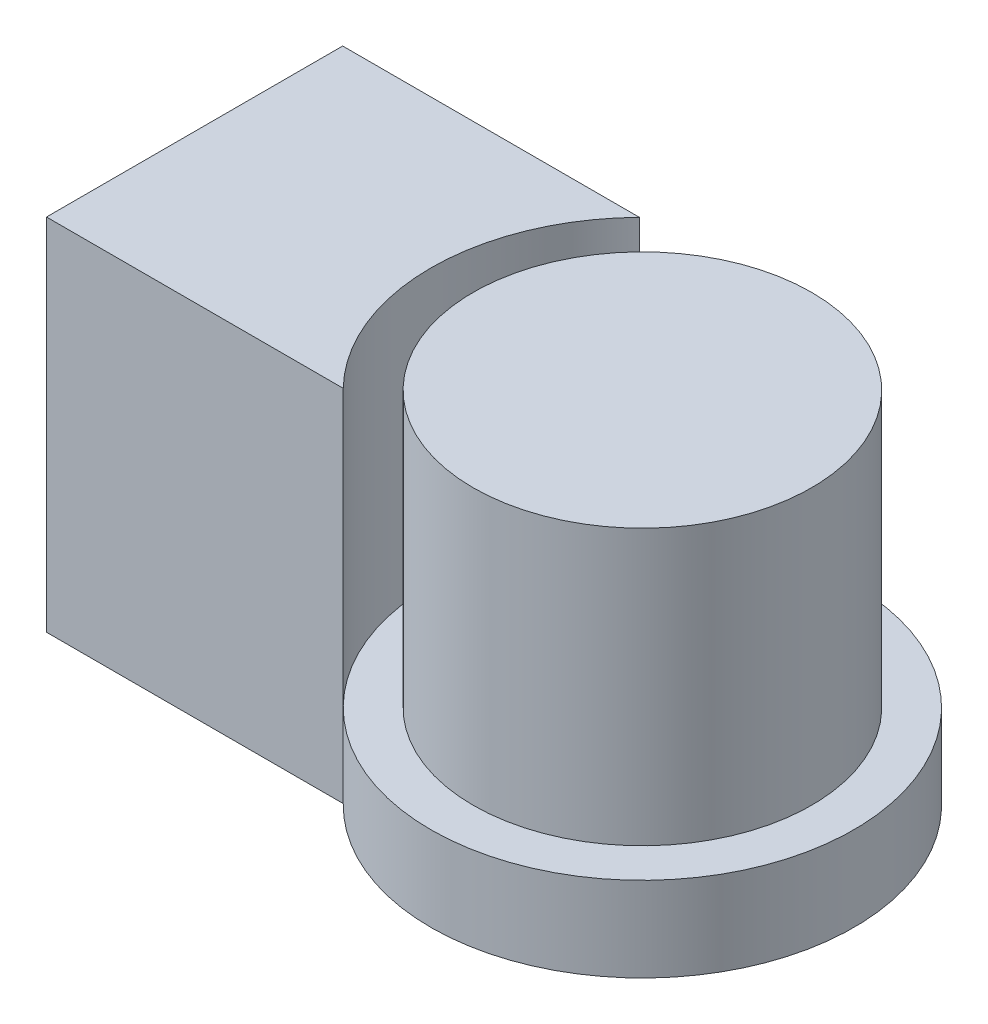
ISO-10303-21;
HEADER;
FILE_DESCRIPTION(('STEP AP214'),'2;1');
FILE_NAME('part.step','',(''),(''),'','','');
FILE_SCHEMA(('AUTOMOTIVE_DESIGN { 1 0 10303 214 1 1 1 1 }'));
ENDSEC;
DATA;
#1=APPLICATION_CONTEXT('core data for automotive mechanical design processes');
#2=APPLICATION_PROTOCOL_DEFINITION('international standard','automotive_design',2000,#1);
#3=PRODUCT_CONTEXT('',#1,'mechanical');
#4=PRODUCT('Part','Part','',(#3));
#5=PRODUCT_RELATED_PRODUCT_CATEGORY('part','',(#4));
#6=PRODUCT_DEFINITION_FORMATION('','',#4);
#7=PRODUCT_DEFINITION_CONTEXT('part definition',#1,'design');
#8=PRODUCT_DEFINITION('design','',#6,#7);
#9=PRODUCT_DEFINITION_SHAPE('','',#8);
#10=(LENGTH_UNIT() NAMED_UNIT(*) SI_UNIT(.MILLI.,.METRE.));
#11=(NAMED_UNIT(*) PLANE_ANGLE_UNIT() SI_UNIT($,.RADIAN.));
#12=(NAMED_UNIT(*) SI_UNIT($,.STERADIAN.) SOLID_ANGLE_UNIT());
#13=UNCERTAINTY_MEASURE_WITH_UNIT(LENGTH_MEASURE(1.E-05),#10,'distance_accuracy_value','');
#14=(GEOMETRIC_REPRESENTATION_CONTEXT(3) GLOBAL_UNCERTAINTY_ASSIGNED_CONTEXT((#13)) GLOBAL_UNIT_ASSIGNED_CONTEXT((#10,
#11,#12)) REPRESENTATION_CONTEXT('',''));
#15=CARTESIAN_POINT('',(0.,0.,0.));
#16=DIRECTION('',(0.,0.,1.));
#17=DIRECTION('',(1.,0.,0.));
#18=AXIS2_PLACEMENT_3D('',#15,#16,#17);
#19=CARTESIAN_POINT('',(0.,85.,0.));
#20=DIRECTION('',(0.,-1.,0.));
#21=DIRECTION('',(0.,0.,-1.));
#22=AXIS2_PLACEMENT_3D('',#19,#20,#21);
#23=CYLINDRICAL_SURFACE('',#22,40.);
#24=CARTESIAN_POINT('',(0.,85.,0.));
#25=DIRECTION('',(0.,1.,0.));
#26=DIRECTION('',(0.,0.,1.));
#27=AXIS2_PLACEMENT_3D('',#24,#25,#26);
#28=CIRCLE('',#27,40.);
#29=CARTESIAN_POINT('',(0.,85.,40.));
#30=VERTEX_POINT('',#29);
#31=EDGE_CURVE('E11',#30,#30,#28,.T.);
#32=ORIENTED_EDGE('',*,*,#31,.F.);
#33=EDGE_LOOP('',(#32));
#34=FACE_BOUND('',#33,.T.);
#35=CARTESIAN_POINT('',(0.,20.,0.));
#36=DIRECTION('',(0.,1.,0.));
#37=DIRECTION('',(0.,0.,1.));
#38=AXIS2_PLACEMENT_3D('',#35,#36,#37);
#39=CIRCLE('',#38,40.);
#40=CARTESIAN_POINT('',(0.,20.,40.));
#41=VERTEX_POINT('',#40);
#42=EDGE_CURVE('E44',#41,#41,#39,.T.);
#43=ORIENTED_EDGE('',*,*,#42,.T.);
#44=EDGE_LOOP('',(#43));
#45=FACE_BOUND('',#44,.T.);
#46=ADVANCED_FACE('F38',(#34,#45),#23,.T.);
#47=CARTESIAN_POINT('',(0.,85.,0.));
#48=DIRECTION('',(0.,1.,0.));
#49=DIRECTION('',(0.,0.,1.));
#50=AXIS2_PLACEMENT_3D('',#47,#48,#49);
#51=PLANE('',#50);
#52=ORIENTED_EDGE('',*,*,#31,.T.);
#53=EDGE_LOOP('',(#52));
#54=FACE_BOUND('',#53,.T.);
#55=ADVANCED_FACE('F53',(#54),#51,.T.);
#56=CARTESIAN_POINT('',(0.,20.,0.));
#57=DIRECTION('',(0.,1.,0.));
#58=DIRECTION('',(0.,0.,1.));
#59=AXIS2_PLACEMENT_3D('',#56,#57,#58);
#60=PLANE('',#59);
#61=ORIENTED_EDGE('',*,*,#42,.F.);
#62=EDGE_LOOP('',(#61));
#63=FACE_BOUND('',#62,.T.);
#64=ADVANCED_FACE('F51',(#63),#60,.F.);
#65=CLOSED_SHELL('',(#46,#55,#64));
#66=MANIFOLD_SOLID_BREP('B2',#65);
#67=CARTESIAN_POINT('',(0.,20.,0.));
#68=DIRECTION('',(0.,-1.,0.));
#69=DIRECTION('',(0.,0.,-1.));
#70=AXIS2_PLACEMENT_3D('',#67,#68,#69);
#71=CYLINDRICAL_SURFACE('',#70,50.);
#72=DIRECTION('',(0.,-1.,0.));
#73=VECTOR('',#72,1.);
#74=CARTESIAN_POINT('',(-35.7071421427143,85.,-35.));
#75=LINE('',#74,#73);
#76=CARTESIAN_POINT('',(-35.7071421427143,20.,-35.));
#77=VERTEX_POINT('',#76);
#78=CARTESIAN_POINT('',(-35.7071421427143,0.,-35.));
#79=VERTEX_POINT('',#78);
#80=EDGE_CURVE('E95',#77,#79,#75,.T.);
#81=ORIENTED_EDGE('',*,*,#80,.F.);
#82=CARTESIAN_POINT('',(0.,20.,0.));
#83=DIRECTION('',(0.,1.,0.));
#84=DIRECTION('',(0.,0.,1.));
#85=AXIS2_PLACEMENT_3D('',#82,#83,#84);
#86=CIRCLE('',#85,50.);
#87=CARTESIAN_POINT('',(-35.7071421427143,20.,35.));
#88=VERTEX_POINT('',#87);
#89=EDGE_CURVE('E85',#88,#77,#86,.T.);
#90=ORIENTED_EDGE('',*,*,#89,.F.);
#91=DIRECTION('',(0.,-1.,0.));
#92=VECTOR('',#91,1.);
#93=CARTESIAN_POINT('',(-35.7071421427143,85.,35.));
#94=LINE('',#93,#92);
#95=CARTESIAN_POINT('',(-35.7071421427143,0.,35.));
#96=VERTEX_POINT('',#95);
#97=EDGE_CURVE('E153',#88,#96,#94,.T.);
#98=ORIENTED_EDGE('',*,*,#97,.T.);
#99=CARTESIAN_POINT('',(0.,0.,0.));
#100=DIRECTION('',(0.,1.,0.));
#101=DIRECTION('',(0.,0.,1.));
#102=AXIS2_PLACEMENT_3D('',#99,#100,#101);
#103=CIRCLE('',#102,50.);
#104=EDGE_CURVE('E159',#96,#79,#103,.T.);
#105=ORIENTED_EDGE('',*,*,#104,.T.);
#106=EDGE_LOOP('',(#81,#90,#98,#105));
#107=FACE_BOUND('',#106,.T.);
#108=ADVANCED_FACE('F78',(#107),#71,.T.);
#109=CARTESIAN_POINT('',(0.,20.,0.));
#110=DIRECTION('',(0.,1.,0.));
#111=DIRECTION('',(0.,0.,1.));
#112=AXIS2_PLACEMENT_3D('',#109,#110,#111);
#113=PLANE('',#112);
#114=EDGE_CURVE('E36',#77,#88,#86,.T.);
#115=ORIENTED_EDGE('',*,*,#114,.T.);
#116=ORIENTED_EDGE('',*,*,#89,.T.);
#117=EDGE_LOOP('',(#115,#116));
#118=FACE_BOUND('',#117,.T.);
#119=ADVANCED_FACE('F162',(#118),#113,.T.);
#120=CARTESIAN_POINT('',(0.,0.,0.));
#121=DIRECTION('',(0.,1.,0.));
#122=DIRECTION('',(0.,0.,1.));
#123=AXIS2_PLACEMENT_3D('',#120,#121,#122);
#124=PLANE('',#123);
#125=ORIENTED_EDGE('',*,*,#104,.F.);
#126=DIRECTION('',(1.,0.,0.));
#127=VECTOR('',#126,1.);
#128=CARTESIAN_POINT('',(-105.838179271709,0.,35.));
#129=LINE('',#128,#127);
#130=CARTESIAN_POINT('',(-105.838179271709,0.,35.));
#131=VERTEX_POINT('',#130);
#132=EDGE_CURVE('E141',#131,#96,#129,.T.);
#133=ORIENTED_EDGE('',*,*,#132,.F.);
#134=DIRECTION('',(0.,0.,1.));
#135=VECTOR('',#134,1.);
#136=CARTESIAN_POINT('',(-105.838179271709,0.,-35.));
#137=LINE('',#136,#135);
#138=CARTESIAN_POINT('',(-105.838179271709,0.,-35.));
#139=VERTEX_POINT('',#138);
#140=EDGE_CURVE('E129',#139,#131,#137,.T.);
#141=ORIENTED_EDGE('',*,*,#140,.F.);
#142=DIRECTION('',(-1.,0.,0.));
#143=VECTOR('',#142,1.);
#144=CARTESIAN_POINT('',(-105.838179271709,0.,-35.));
#145=LINE('',#144,#143);
#146=EDGE_CURVE('E121',#79,#139,#145,.T.);
#147=ORIENTED_EDGE('',*,*,#146,.F.);
#148=EDGE_LOOP('',(#125,#133,#141,#147));
#149=FACE_BOUND('',#148,.T.);
#150=ADVANCED_FACE('F139',(#149),#124,.F.);
#151=CARTESIAN_POINT('',(0.,85.,0.));
#152=DIRECTION('',(0.,-1.,0.));
#153=DIRECTION('',(0.,0.,-1.));
#154=AXIS2_PLACEMENT_3D('',#151,#152,#153);
#155=CYLINDRICAL_SURFACE('',#154,50.);
#156=ORIENTED_EDGE('',*,*,#114,.F.);
#157=CARTESIAN_POINT('',(-35.7071421427143,85.,-35.));
#158=VERTEX_POINT('',#157);
#159=EDGE_CURVE('E158',#158,#77,#75,.T.);
#160=ORIENTED_EDGE('',*,*,#159,.F.);
#161=CARTESIAN_POINT('',(0.,85.,0.));
#162=DIRECTION('',(0.,-1.,0.));
#163=DIRECTION('',(0.,0.,1.));
#164=AXIS2_PLACEMENT_3D('',#161,#162,#163);
#165=CIRCLE('',#164,50.);
#166=CARTESIAN_POINT('',(-35.7071421427143,85.,35.));
#167=VERTEX_POINT('',#166);
#168=EDGE_CURVE('E143',#167,#158,#165,.T.);
#169=ORIENTED_EDGE('',*,*,#168,.F.);
#170=EDGE_CURVE('E154',#167,#88,#94,.T.);
#171=ORIENTED_EDGE('',*,*,#170,.T.);
#172=EDGE_LOOP('',(#156,#160,#169,#171));
#173=FACE_BOUND('',#172,.T.);
#174=ADVANCED_FACE('F166',(#173),#155,.F.);
#175=CARTESIAN_POINT('',(-105.838179271709,85.,-35.));
#176=DIRECTION('',(0.,0.,1.));
#177=DIRECTION('',(1.,0.,0.));
#178=AXIS2_PLACEMENT_3D('',#175,#176,#177);
#179=PLANE('',#178);
#180=ORIENTED_EDGE('',*,*,#146,.T.);
#181=DIRECTION('',(0.,-1.,0.));
#182=VECTOR('',#181,1.);
#183=CARTESIAN_POINT('',(-105.838179271709,85.,-35.));
#184=LINE('',#183,#182);
#185=CARTESIAN_POINT('',(-105.838179271709,85.,-35.));
#186=VERTEX_POINT('',#185);
#187=EDGE_CURVE('E124',#186,#139,#184,.T.);
#188=ORIENTED_EDGE('',*,*,#187,.F.);
#189=DIRECTION('',(-1.,0.,0.));
#190=VECTOR('',#189,1.);
#191=CARTESIAN_POINT('',(-105.838179271709,85.,-35.));
#192=LINE('',#191,#190);
#193=EDGE_CURVE('E148',#158,#186,#192,.T.);
#194=ORIENTED_EDGE('',*,*,#193,.F.);
#195=ORIENTED_EDGE('',*,*,#159,.T.);
#196=ORIENTED_EDGE('',*,*,#80,.T.);
#197=EDGE_LOOP('',(#180,#188,#194,#195,#196));
#198=FACE_BOUND('',#197,.T.);
#199=ADVANCED_FACE('F123',(#198),#179,.F.);
#200=CARTESIAN_POINT('',(-105.838179271709,85.,-35.));
#201=DIRECTION('',(1.,0.,0.));
#202=DIRECTION('',(0.,0.,-1.));
#203=AXIS2_PLACEMENT_3D('',#200,#201,#202);
#204=PLANE('',#203);
#205=ORIENTED_EDGE('',*,*,#140,.T.);
#206=DIRECTION('',(0.,-1.,0.));
#207=VECTOR('',#206,1.);
#208=CARTESIAN_POINT('',(-105.838179271709,85.,35.));
#209=LINE('',#208,#207);
#210=CARTESIAN_POINT('',(-105.838179271709,85.,35.));
#211=VERTEX_POINT('',#210);
#212=EDGE_CURVE('E136',#211,#131,#209,.T.);
#213=ORIENTED_EDGE('',*,*,#212,.F.);
#214=DIRECTION('',(0.,0.,1.));
#215=VECTOR('',#214,1.);
#216=CARTESIAN_POINT('',(-105.838179271709,85.,-35.));
#217=LINE('',#216,#215);
#218=EDGE_CURVE('E135',#186,#211,#217,.T.);
#219=ORIENTED_EDGE('',*,*,#218,.F.);
#220=ORIENTED_EDGE('',*,*,#187,.T.);
#221=EDGE_LOOP('',(#205,#213,#219,#220));
#222=FACE_BOUND('',#221,.T.);
#223=ADVANCED_FACE('F132',(#222),#204,.F.);
#224=CARTESIAN_POINT('',(-105.838179271709,85.,35.));
#225=DIRECTION('',(0.,0.,-1.));
#226=DIRECTION('',(-1.,0.,0.));
#227=AXIS2_PLACEMENT_3D('',#224,#225,#226);
#228=PLANE('',#227);
#229=ORIENTED_EDGE('',*,*,#132,.T.);
#230=ORIENTED_EDGE('',*,*,#97,.F.);
#231=ORIENTED_EDGE('',*,*,#170,.F.);
#232=DIRECTION('',(1.,0.,0.));
#233=VECTOR('',#232,1.);
#234=CARTESIAN_POINT('',(-105.838179271709,85.,35.));
#235=LINE('',#234,#233);
#236=EDGE_CURVE('E151',#211,#167,#235,.T.);
#237=ORIENTED_EDGE('',*,*,#236,.F.);
#238=ORIENTED_EDGE('',*,*,#212,.T.);
#239=EDGE_LOOP('',(#229,#230,#231,#237,#238));
#240=FACE_BOUND('',#239,.T.);
#241=ADVANCED_FACE('F173',(#240),#228,.F.);
#242=CARTESIAN_POINT('',(0.,85.,0.));
#243=DIRECTION('',(0.,1.,0.));
#244=DIRECTION('',(0.,0.,1.));
#245=AXIS2_PLACEMENT_3D('',#242,#243,#244);
#246=PLANE('',#245);
#247=ORIENTED_EDGE('',*,*,#168,.T.);
#248=ORIENTED_EDGE('',*,*,#193,.T.);
#249=ORIENTED_EDGE('',*,*,#218,.T.);
#250=ORIENTED_EDGE('',*,*,#236,.T.);
#251=EDGE_LOOP('',(#247,#248,#249,#250));
#252=FACE_BOUND('',#251,.T.);
#253=ADVANCED_FACE('F170',(#252),#246,.T.);
#254=CLOSED_SHELL('',(#108,#119,#150,#174,#199,#223,#241,#253));
#255=MANIFOLD_SOLID_BREP('B6',#254);
#256=ADVANCED_BREP_SHAPE_REPRESENTATION('',(#18,#66,#255),#14);
#257=SHAPE_DEFINITION_REPRESENTATION(#9,#256);
ENDSEC;
END-ISO-10303-21;
